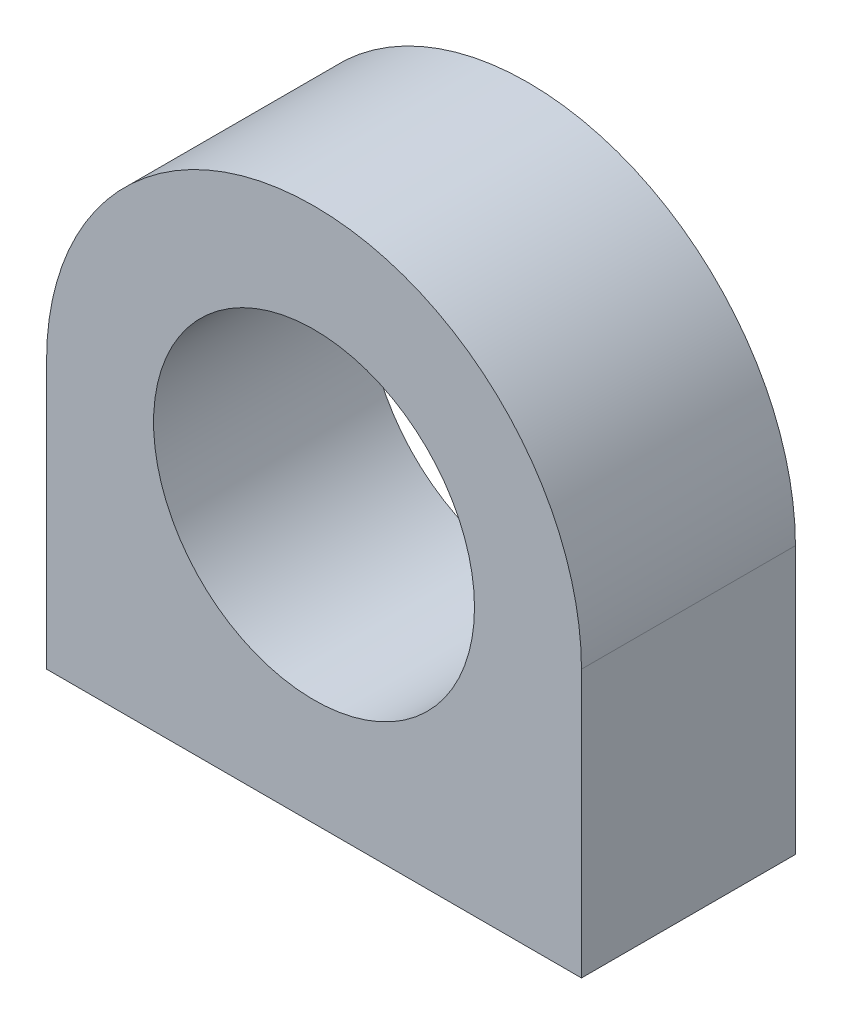
ISO-10303-21;
HEADER;
FILE_DESCRIPTION(('STEP AP214'),'2;1');
FILE_NAME('part.step','',(''),(''),'','','');
FILE_SCHEMA(('AUTOMOTIVE_DESIGN { 1 0 10303 214 1 1 1 1 }'));
ENDSEC;
DATA;
#1=APPLICATION_CONTEXT('core data for automotive mechanical design processes');
#2=APPLICATION_PROTOCOL_DEFINITION('international standard','automotive_design',2000,#1);
#3=PRODUCT_CONTEXT('',#1,'mechanical');
#4=PRODUCT('Part','Part','',(#3));
#5=PRODUCT_RELATED_PRODUCT_CATEGORY('part','',(#4));
#6=PRODUCT_DEFINITION_FORMATION('','',#4);
#7=PRODUCT_DEFINITION_CONTEXT('part definition',#1,'design');
#8=PRODUCT_DEFINITION('design','',#6,#7);
#9=PRODUCT_DEFINITION_SHAPE('','',#8);
#10=(LENGTH_UNIT() NAMED_UNIT(*) SI_UNIT(.MILLI.,.METRE.));
#11=(NAMED_UNIT(*) PLANE_ANGLE_UNIT() SI_UNIT($,.RADIAN.));
#12=(NAMED_UNIT(*) SI_UNIT($,.STERADIAN.) SOLID_ANGLE_UNIT());
#13=UNCERTAINTY_MEASURE_WITH_UNIT(LENGTH_MEASURE(1.E-05),#10,'distance_accuracy_value','');
#14=(GEOMETRIC_REPRESENTATION_CONTEXT(3) GLOBAL_UNCERTAINTY_ASSIGNED_CONTEXT((#13)) GLOBAL_UNIT_ASSIGNED_CONTEXT((#10,
#11,#12)) REPRESENTATION_CONTEXT('',''));
#15=CARTESIAN_POINT('',(0.,0.,0.));
#16=DIRECTION('',(0.,0.,1.));
#17=DIRECTION('',(1.,0.,0.));
#18=AXIS2_PLACEMENT_3D('',#15,#16,#17);
#19=CARTESIAN_POINT('',(0.,2.5,4.));
#20=DIRECTION('',(0.,0.,-1.));
#21=DIRECTION('',(-1.,0.,0.));
#22=AXIS2_PLACEMENT_3D('',#19,#20,#21);
#23=PLANE('',#22);
#24=CARTESIAN_POINT('',(0.,2.5,4.));
#25=DIRECTION('',(0.,0.,1.));
#26=DIRECTION('',(-1.,0.,0.));
#27=AXIS2_PLACEMENT_3D('',#24,#25,#26);
#28=CIRCLE('',#27,5.);
#29=CARTESIAN_POINT('',(5.,2.5,4.));
#30=VERTEX_POINT('',#29);
#31=CARTESIAN_POINT('',(-5.,2.5,4.));
#32=VERTEX_POINT('',#31);
#33=EDGE_CURVE('E85',#30,#32,#28,.T.);
#34=ORIENTED_EDGE('',*,*,#33,.T.);
#35=DIRECTION('',(0.,-1.,0.));
#36=VECTOR('',#35,1.);
#37=CARTESIAN_POINT('',(-5.,-2.5,4.));
#38=LINE('',#37,#36);
#39=CARTESIAN_POINT('',(-5.,-2.5,4.));
#40=VERTEX_POINT('',#39);
#41=EDGE_CURVE('E80',#32,#40,#38,.T.);
#42=ORIENTED_EDGE('',*,*,#41,.T.);
#43=DIRECTION('',(1.,0.,0.));
#44=VECTOR('',#43,1.);
#45=CARTESIAN_POINT('',(-5.,-2.5,4.));
#46=LINE('',#45,#44);
#47=CARTESIAN_POINT('',(5.,-2.5,4.));
#48=VERTEX_POINT('',#47);
#49=EDGE_CURVE('E83',#40,#48,#46,.T.);
#50=ORIENTED_EDGE('',*,*,#49,.T.);
#51=DIRECTION('',(0.,1.,0.));
#52=VECTOR('',#51,1.);
#53=CARTESIAN_POINT('',(5.,-2.5,4.));
#54=LINE('',#53,#52);
#55=EDGE_CURVE('E50',#48,#30,#54,.T.);
#56=ORIENTED_EDGE('',*,*,#55,.T.);
#57=EDGE_LOOP('',(#34,#42,#50,#56));
#58=FACE_BOUND('',#57,.T.);
#59=CARTESIAN_POINT('',(0.,2.5,4.));
#60=DIRECTION('',(0.,0.,1.));
#61=DIRECTION('',(1.,0.,0.));
#62=AXIS2_PLACEMENT_3D('',#59,#60,#61);
#63=CIRCLE('',#62,3.);
#64=CARTESIAN_POINT('',(3.,2.5,4.));
#65=VERTEX_POINT('',#64);
#66=EDGE_CURVE('E100',#65,#65,#63,.T.);
#67=ORIENTED_EDGE('',*,*,#66,.F.);
#68=EDGE_LOOP('',(#67));
#69=FACE_BOUND('',#68,.T.);
#70=ADVANCED_FACE('F33',(#58,#69),#23,.F.);
#71=CARTESIAN_POINT('',(0.,2.5,0.));
#72=DIRECTION('',(0.,0.,-1.));
#73=DIRECTION('',(-1.,0.,0.));
#74=AXIS2_PLACEMENT_3D('',#71,#72,#73);
#75=PLANE('',#74);
#76=CARTESIAN_POINT('',(0.,2.5,0.));
#77=DIRECTION('',(0.,0.,1.));
#78=DIRECTION('',(-1.,0.,0.));
#79=AXIS2_PLACEMENT_3D('',#76,#77,#78);
#80=CIRCLE('',#79,5.);
#81=CARTESIAN_POINT('',(5.,2.5,0.));
#82=VERTEX_POINT('',#81);
#83=CARTESIAN_POINT('',(-5.,2.5,0.));
#84=VERTEX_POINT('',#83);
#85=EDGE_CURVE('E97',#82,#84,#80,.T.);
#86=ORIENTED_EDGE('',*,*,#85,.F.);
#87=DIRECTION('',(0.,1.,0.));
#88=VECTOR('',#87,1.);
#89=CARTESIAN_POINT('',(5.,-2.5,0.));
#90=LINE('',#89,#88);
#91=CARTESIAN_POINT('',(5.,-2.5,0.));
#92=VERTEX_POINT('',#91);
#93=EDGE_CURVE('E73',#92,#82,#90,.T.);
#94=ORIENTED_EDGE('',*,*,#93,.F.);
#95=DIRECTION('',(1.,0.,0.));
#96=VECTOR('',#95,1.);
#97=CARTESIAN_POINT('',(-5.,-2.5,0.));
#98=LINE('',#97,#96);
#99=CARTESIAN_POINT('',(-5.,-2.5,0.));
#100=VERTEX_POINT('',#99);
#101=EDGE_CURVE('E67',#100,#92,#98,.T.);
#102=ORIENTED_EDGE('',*,*,#101,.F.);
#103=DIRECTION('',(0.,-1.,0.));
#104=VECTOR('',#103,1.);
#105=CARTESIAN_POINT('',(-5.,-2.5,0.));
#106=LINE('',#105,#104);
#107=EDGE_CURVE('E89',#84,#100,#106,.T.);
#108=ORIENTED_EDGE('',*,*,#107,.F.);
#109=EDGE_LOOP('',(#86,#94,#102,#108));
#110=FACE_BOUND('',#109,.T.);
#111=CARTESIAN_POINT('',(0.,2.5,0.));
#112=DIRECTION('',(0.,0.,1.));
#113=DIRECTION('',(1.,0.,0.));
#114=AXIS2_PLACEMENT_3D('',#111,#112,#113);
#115=CIRCLE('',#114,3.);
#116=CARTESIAN_POINT('',(3.,2.5,0.));
#117=VERTEX_POINT('',#116);
#118=EDGE_CURVE('E112',#117,#117,#115,.T.);
#119=ORIENTED_EDGE('',*,*,#118,.T.);
#120=EDGE_LOOP('',(#119));
#121=FACE_BOUND('',#120,.T.);
#122=ADVANCED_FACE('F108',(#110,#121),#75,.T.);
#123=CARTESIAN_POINT('',(0.,2.5,4.));
#124=DIRECTION('',(0.,0.,-1.));
#125=DIRECTION('',(-1.,0.,0.));
#126=AXIS2_PLACEMENT_3D('',#123,#124,#125);
#127=CYLINDRICAL_SURFACE('',#126,5.);
#128=ORIENTED_EDGE('',*,*,#85,.T.);
#129=DIRECTION('',(0.,0.,-1.));
#130=VECTOR('',#129,1.);
#131=CARTESIAN_POINT('',(-5.,2.5,4.));
#132=LINE('',#131,#130);
#133=EDGE_CURVE('E11',#32,#84,#132,.T.);
#134=ORIENTED_EDGE('',*,*,#133,.F.);
#135=ORIENTED_EDGE('',*,*,#33,.F.);
#136=DIRECTION('',(0.,0.,-1.));
#137=VECTOR('',#136,1.);
#138=CARTESIAN_POINT('',(5.,2.5,4.));
#139=LINE('',#138,#137);
#140=EDGE_CURVE('E93',#30,#82,#139,.T.);
#141=ORIENTED_EDGE('',*,*,#140,.T.);
#142=EDGE_LOOP('',(#128,#134,#135,#141));
#143=FACE_BOUND('',#142,.T.);
#144=ADVANCED_FACE('F35',(#143),#127,.T.);
#145=CARTESIAN_POINT('',(-5.,-2.5,4.));
#146=DIRECTION('',(1.,0.,0.));
#147=DIRECTION('',(0.,0.,-1.));
#148=AXIS2_PLACEMENT_3D('',#145,#146,#147);
#149=PLANE('',#148);
#150=ORIENTED_EDGE('',*,*,#107,.T.);
#151=DIRECTION('',(0.,0.,-1.));
#152=VECTOR('',#151,1.);
#153=CARTESIAN_POINT('',(-5.,-2.5,4.));
#154=LINE('',#153,#152);
#155=EDGE_CURVE('E42',#40,#100,#154,.T.);
#156=ORIENTED_EDGE('',*,*,#155,.F.);
#157=ORIENTED_EDGE('',*,*,#41,.F.);
#158=ORIENTED_EDGE('',*,*,#133,.T.);
#159=EDGE_LOOP('',(#150,#156,#157,#158));
#160=FACE_BOUND('',#159,.T.);
#161=ADVANCED_FACE('F88',(#160),#149,.F.);
#162=CARTESIAN_POINT('',(-5.,-2.5,4.));
#163=DIRECTION('',(0.,1.,0.));
#164=DIRECTION('',(0.,0.,1.));
#165=AXIS2_PLACEMENT_3D('',#162,#163,#164);
#166=PLANE('',#165);
#167=ORIENTED_EDGE('',*,*,#101,.T.);
#168=DIRECTION('',(0.,0.,-1.));
#169=VECTOR('',#168,1.);
#170=CARTESIAN_POINT('',(5.,-2.5,4.));
#171=LINE('',#170,#169);
#172=EDGE_CURVE('E90',#48,#92,#171,.T.);
#173=ORIENTED_EDGE('',*,*,#172,.F.);
#174=ORIENTED_EDGE('',*,*,#49,.F.);
#175=ORIENTED_EDGE('',*,*,#155,.T.);
#176=EDGE_LOOP('',(#167,#173,#174,#175));
#177=FACE_BOUND('',#176,.T.);
#178=ADVANCED_FACE('F91',(#177),#166,.F.);
#179=CARTESIAN_POINT('',(5.,-2.5,4.));
#180=DIRECTION('',(-1.,0.,0.));
#181=DIRECTION('',(0.,0.,1.));
#182=AXIS2_PLACEMENT_3D('',#179,#180,#181);
#183=PLANE('',#182);
#184=ORIENTED_EDGE('',*,*,#93,.T.);
#185=ORIENTED_EDGE('',*,*,#140,.F.);
#186=ORIENTED_EDGE('',*,*,#55,.F.);
#187=ORIENTED_EDGE('',*,*,#172,.T.);
#188=EDGE_LOOP('',(#184,#185,#186,#187));
#189=FACE_BOUND('',#188,.T.);
#190=ADVANCED_FACE('F105',(#189),#183,.F.);
#191=CARTESIAN_POINT('',(0.,2.5,4.));
#192=DIRECTION('',(0.,0.,-1.));
#193=DIRECTION('',(-1.,0.,0.));
#194=AXIS2_PLACEMENT_3D('',#191,#192,#193);
#195=CYLINDRICAL_SURFACE('',#194,3.);
#196=ORIENTED_EDGE('',*,*,#66,.T.);
#197=EDGE_LOOP('',(#196));
#198=FACE_BOUND('',#197,.T.);
#199=ORIENTED_EDGE('',*,*,#118,.F.);
#200=EDGE_LOOP('',(#199));
#201=FACE_BOUND('',#200,.T.);
#202=ADVANCED_FACE('F118',(#198,#201),#195,.F.);
#203=CLOSED_SHELL('',(#70,#122,#144,#161,#178,#190,#202));
#204=MANIFOLD_SOLID_BREP('B2',#203);
#205=ADVANCED_BREP_SHAPE_REPRESENTATION('',(#18,#204),#14);
#206=SHAPE_DEFINITION_REPRESENTATION(#9,#205);
ENDSEC;
END-ISO-10303-21;
